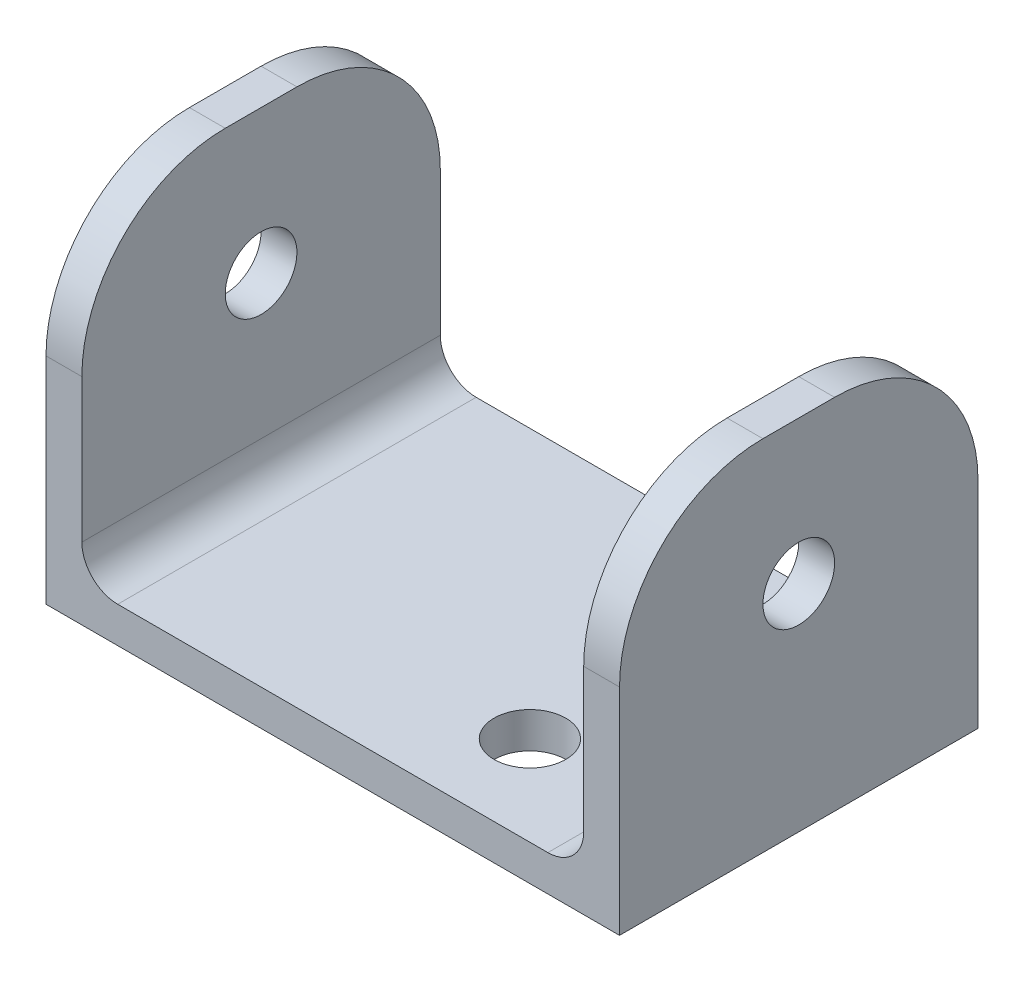
ISO-10303-21;
HEADER;
FILE_DESCRIPTION(('STEP AP214'),'2;1');
FILE_NAME('part.step','',(''),(''),'','','');
FILE_SCHEMA(('AUTOMOTIVE_DESIGN { 1 0 10303 214 1 1 1 1 }'));
ENDSEC;
DATA;
#1=APPLICATION_CONTEXT('core data for automotive mechanical design processes');
#2=APPLICATION_PROTOCOL_DEFINITION('international standard','automotive_design',2000,#1);
#3=PRODUCT_CONTEXT('',#1,'mechanical');
#4=PRODUCT('Part','Part','',(#3));
#5=PRODUCT_RELATED_PRODUCT_CATEGORY('part','',(#4));
#6=PRODUCT_DEFINITION_FORMATION('','',#4);
#7=PRODUCT_DEFINITION_CONTEXT('part definition',#1,'design');
#8=PRODUCT_DEFINITION('design','',#6,#7);
#9=PRODUCT_DEFINITION_SHAPE('','',#8);
#10=(LENGTH_UNIT() NAMED_UNIT(*) SI_UNIT(.MILLI.,.METRE.));
#11=(NAMED_UNIT(*) PLANE_ANGLE_UNIT() SI_UNIT($,.RADIAN.));
#12=(NAMED_UNIT(*) SI_UNIT($,.STERADIAN.) SOLID_ANGLE_UNIT());
#13=UNCERTAINTY_MEASURE_WITH_UNIT(LENGTH_MEASURE(1.E-05),#10,'distance_accuracy_value','');
#14=(GEOMETRIC_REPRESENTATION_CONTEXT(3) GLOBAL_UNCERTAINTY_ASSIGNED_CONTEXT((#13)) GLOBAL_UNIT_ASSIGNED_CONTEXT((#10,
#11,#12)) REPRESENTATION_CONTEXT('',''));
#15=CARTESIAN_POINT('',(0.,0.,0.));
#16=DIRECTION('',(0.,0.,1.));
#17=DIRECTION('',(1.,0.,0.));
#18=AXIS2_PLACEMENT_3D('',#15,#16,#17);
#19=CARTESIAN_POINT('',(-25.4,15.875,-15.875));
#20=DIRECTION('',(0.,-1.,0.));
#21=DIRECTION('',(0.,0.,1.));
#22=AXIS2_PLACEMENT_3D('',#19,#20,#21);
#23=PLANE('',#22);
#24=DIRECTION('',(0.,0.,1.));
#25=VECTOR('',#24,1.);
#26=CARTESIAN_POINT('',(-25.4,15.875,-15.875));
#27=LINE('',#26,#25);
#28=CARTESIAN_POINT('',(-25.4,15.875,-3.175));
#29=VERTEX_POINT('',#28);
#30=CARTESIAN_POINT('',(-25.4,15.875,3.175));
#31=VERTEX_POINT('',#30);
#32=EDGE_CURVE('E157',#29,#31,#27,.T.);
#33=ORIENTED_EDGE('',*,*,#32,.T.);
#34=DIRECTION('',(-1.,0.,0.));
#35=VECTOR('',#34,1.);
#36=CARTESIAN_POINT('',(-25.4,15.875,3.175));
#37=LINE('',#36,#35);
#38=CARTESIAN_POINT('',(-22.225,15.875,3.175));
#39=VERTEX_POINT('',#38);
#40=EDGE_CURVE('E214',#39,#31,#37,.T.);
#41=ORIENTED_EDGE('',*,*,#40,.F.);
#42=DIRECTION('',(0.,0.,-1.));
#43=VECTOR('',#42,1.);
#44=CARTESIAN_POINT('',(-22.225,15.875,15.875));
#45=LINE('',#44,#43);
#46=CARTESIAN_POINT('',(-22.225,15.875,-3.175));
#47=VERTEX_POINT('',#46);
#48=EDGE_CURVE('E171',#39,#47,#45,.T.);
#49=ORIENTED_EDGE('',*,*,#48,.T.);
#50=DIRECTION('',(-1.,0.,0.));
#51=VECTOR('',#50,1.);
#52=CARTESIAN_POINT('',(-22.225,15.875,-3.175));
#53=LINE('',#52,#51);
#54=EDGE_CURVE('E217',#29,#47,#53,.F.);
#55=ORIENTED_EDGE('',*,*,#54,.F.);
#56=EDGE_LOOP('',(#33,#41,#49,#55));
#57=FACE_BOUND('',#56,.T.);
#58=ADVANCED_FACE('F34',(#57),#23,.F.);
#59=CARTESIAN_POINT('',(25.4,15.875,-15.875));
#60=DIRECTION('',(-1.,0.,0.));
#61=DIRECTION('',(0.,0.,-1.));
#62=AXIS2_PLACEMENT_3D('',#59,#60,#61);
#63=PLANE('',#62);
#64=CARTESIAN_POINT('',(25.4,3.17500000000001,0.));
#65=DIRECTION('',(-1.,0.,0.));
#66=DIRECTION('',(0.,1.,0.));
#67=AXIS2_PLACEMENT_3D('',#64,#65,#66);
#68=CIRCLE('',#67,3.175);
#69=CARTESIAN_POINT('',(25.4,6.35000000000001,0.));
#70=VERTEX_POINT('',#69);
#71=EDGE_CURVE('E296',#70,#70,#68,.T.);
#72=ORIENTED_EDGE('',*,*,#71,.T.);
#73=EDGE_LOOP('',(#72));
#74=FACE_BOUND('',#73,.T.);
#75=DIRECTION('',(0.,1.,0.));
#76=VECTOR('',#75,1.);
#77=CARTESIAN_POINT('',(25.4,15.875,15.875));
#78=LINE('',#77,#76);
#79=CARTESIAN_POINT('',(25.4,-15.875,15.875));
#80=VERTEX_POINT('',#79);
#81=CARTESIAN_POINT('',(25.4,3.175,15.875));
#82=VERTEX_POINT('',#81);
#83=EDGE_CURVE('E167',#80,#82,#78,.T.);
#84=ORIENTED_EDGE('',*,*,#83,.F.);
#85=DIRECTION('',(0.,0.,1.));
#86=VECTOR('',#85,1.);
#87=CARTESIAN_POINT('',(25.4,-15.875,-15.875));
#88=LINE('',#87,#86);
#89=CARTESIAN_POINT('',(25.4,-15.875,-15.875));
#90=VERTEX_POINT('',#89);
#91=EDGE_CURVE('E148',#90,#80,#88,.T.);
#92=ORIENTED_EDGE('',*,*,#91,.F.);
#93=DIRECTION('',(0.,1.,0.));
#94=VECTOR('',#93,1.);
#95=CARTESIAN_POINT('',(25.4,15.875,-15.875));
#96=LINE('',#95,#94);
#97=CARTESIAN_POINT('',(25.4,3.175,-15.875));
#98=VERTEX_POINT('',#97);
#99=EDGE_CURVE('E144',#90,#98,#96,.T.);
#100=ORIENTED_EDGE('',*,*,#99,.T.);
#101=CARTESIAN_POINT('',(25.4,3.175,-3.175));
#102=DIRECTION('',(1.,0.,0.));
#103=DIRECTION('',(0.,0.,-1.));
#104=AXIS2_PLACEMENT_3D('',#101,#102,#103);
#105=CIRCLE('',#104,12.7);
#106=CARTESIAN_POINT('',(25.4,15.875,-3.175));
#107=VERTEX_POINT('',#106);
#108=EDGE_CURVE('E42',#107,#98,#105,.F.);
#109=ORIENTED_EDGE('',*,*,#108,.F.);
#110=DIRECTION('',(0.,0.,1.));
#111=VECTOR('',#110,1.);
#112=CARTESIAN_POINT('',(25.4,15.875,-15.875));
#113=LINE('',#112,#111);
#114=CARTESIAN_POINT('',(25.4,15.875,3.175));
#115=VERTEX_POINT('',#114);
#116=EDGE_CURVE('E177',#107,#115,#113,.T.);
#117=ORIENTED_EDGE('',*,*,#116,.T.);
#118=CARTESIAN_POINT('',(25.4,3.175,3.175));
#119=DIRECTION('',(1.,0.,0.));
#120=DIRECTION('',(0.,0.,-1.));
#121=AXIS2_PLACEMENT_3D('',#118,#119,#120);
#122=CIRCLE('',#121,12.7);
#123=EDGE_CURVE('E11',#82,#115,#122,.F.);
#124=ORIENTED_EDGE('',*,*,#123,.F.);
#125=EDGE_LOOP('',(#84,#92,#100,#109,#117,#124));
#126=FACE_BOUND('',#125,.T.);
#127=ADVANCED_FACE('F238',(#74,#126),#63,.F.);
#128=ORIENTED_EDGE('',*,*,#116,.F.);
#129=DIRECTION('',(-1.,0.,0.));
#130=VECTOR('',#129,1.);
#131=CARTESIAN_POINT('',(25.4,15.875,-3.175));
#132=LINE('',#131,#130);
#133=CARTESIAN_POINT('',(22.225,15.875,-3.175));
#134=VERTEX_POINT('',#133);
#135=EDGE_CURVE('E56',#134,#107,#132,.F.);
#136=ORIENTED_EDGE('',*,*,#135,.F.);
#137=DIRECTION('',(0.,0.,-1.));
#138=VECTOR('',#137,1.);
#139=CARTESIAN_POINT('',(22.225,15.875,15.875));
#140=LINE('',#139,#138);
#141=CARTESIAN_POINT('',(22.225,15.875,3.175));
#142=VERTEX_POINT('',#141);
#143=EDGE_CURVE('E275',#142,#134,#140,.T.);
#144=ORIENTED_EDGE('',*,*,#143,.F.);
#145=DIRECTION('',(-1.,0.,0.));
#146=VECTOR('',#145,1.);
#147=CARTESIAN_POINT('',(-25.4,15.875,3.175));
#148=LINE('',#147,#146);
#149=EDGE_CURVE('E49',#115,#142,#148,.T.);
#150=ORIENTED_EDGE('',*,*,#149,.F.);
#151=EDGE_LOOP('',(#128,#136,#144,#150));
#152=FACE_BOUND('',#151,.T.);
#153=ADVANCED_FACE('F306',(#152),#23,.F.);
#154=CARTESIAN_POINT('',(-25.4,15.875,-15.875));
#155=DIRECTION('',(1.,0.,0.));
#156=DIRECTION('',(0.,0.,1.));
#157=AXIS2_PLACEMENT_3D('',#154,#155,#156);
#158=PLANE('',#157);
#159=CARTESIAN_POINT('',(-25.4,3.175,0.));
#160=DIRECTION('',(-1.,0.,0.));
#161=DIRECTION('',(0.,1.,0.));
#162=AXIS2_PLACEMENT_3D('',#159,#160,#161);
#163=CIRCLE('',#162,3.175);
#164=CARTESIAN_POINT('',(-25.4,6.35,0.));
#165=VERTEX_POINT('',#164);
#166=EDGE_CURVE('E205',#165,#165,#163,.T.);
#167=ORIENTED_EDGE('',*,*,#166,.F.);
#168=EDGE_LOOP('',(#167));
#169=FACE_BOUND('',#168,.T.);
#170=DIRECTION('',(0.,-1.,0.));
#171=VECTOR('',#170,1.);
#172=CARTESIAN_POINT('',(-25.4,15.875,-15.875));
#173=LINE('',#172,#171);
#174=CARTESIAN_POINT('',(-25.4,3.175,-15.875));
#175=VERTEX_POINT('',#174);
#176=CARTESIAN_POINT('',(-25.4,-15.875,-15.875));
#177=VERTEX_POINT('',#176);
#178=EDGE_CURVE('E142',#175,#177,#173,.T.);
#179=ORIENTED_EDGE('',*,*,#178,.T.);
#180=DIRECTION('',(0.,0.,1.));
#181=VECTOR('',#180,1.);
#182=CARTESIAN_POINT('',(-25.4,-15.875,-15.875));
#183=LINE('',#182,#181);
#184=CARTESIAN_POINT('',(-25.4,-15.875,15.875));
#185=VERTEX_POINT('',#184);
#186=EDGE_CURVE('E151',#177,#185,#183,.T.);
#187=ORIENTED_EDGE('',*,*,#186,.T.);
#188=DIRECTION('',(0.,-1.,0.));
#189=VECTOR('',#188,1.);
#190=CARTESIAN_POINT('',(-25.4,15.875,15.875));
#191=LINE('',#190,#189);
#192=CARTESIAN_POINT('',(-25.4,3.175,15.875));
#193=VERTEX_POINT('',#192);
#194=EDGE_CURVE('E170',#193,#185,#191,.T.);
#195=ORIENTED_EDGE('',*,*,#194,.F.);
#196=CARTESIAN_POINT('',(-25.4,3.175,3.175));
#197=DIRECTION('',(-1.,0.,0.));
#198=DIRECTION('',(0.,0.,1.));
#199=AXIS2_PLACEMENT_3D('',#196,#197,#198);
#200=CIRCLE('',#199,12.7);
#201=EDGE_CURVE('E210',#31,#193,#200,.F.);
#202=ORIENTED_EDGE('',*,*,#201,.F.);
#203=ORIENTED_EDGE('',*,*,#32,.F.);
#204=CARTESIAN_POINT('',(-25.4,3.175,-3.175));
#205=DIRECTION('',(-1.,0.,0.));
#206=DIRECTION('',(0.,0.,1.));
#207=AXIS2_PLACEMENT_3D('',#204,#205,#206);
#208=CIRCLE('',#207,12.7);
#209=EDGE_CURVE('E162',#175,#29,#208,.F.);
#210=ORIENTED_EDGE('',*,*,#209,.F.);
#211=EDGE_LOOP('',(#179,#187,#195,#202,#203,#210));
#212=FACE_BOUND('',#211,.T.);
#213=ADVANCED_FACE('F160',(#169,#212),#158,.F.);
#214=CARTESIAN_POINT('',(-25.4,-15.875,-15.875));
#215=DIRECTION('',(0.,1.,0.));
#216=DIRECTION('',(0.,0.,-1.));
#217=AXIS2_PLACEMENT_3D('',#214,#215,#216);
#218=PLANE('',#217);
#219=CARTESIAN_POINT('',(9.52500000000001,-15.875,-7.9375));
#220=DIRECTION('',(0.,-1.,0.));
#221=DIRECTION('',(0.,0.,-1.));
#222=AXIS2_PLACEMENT_3D('',#219,#220,#221);
#223=CIRCLE('',#222,3.175);
#224=CARTESIAN_POINT('',(9.52500000000001,-15.875,-11.1125));
#225=VERTEX_POINT('',#224);
#226=EDGE_CURVE('E287',#225,#225,#223,.T.);
#227=ORIENTED_EDGE('',*,*,#226,.F.);
#228=EDGE_LOOP('',(#227));
#229=FACE_BOUND('',#228,.T.);
#230=CARTESIAN_POINT('',(9.52500000000001,-15.875,7.9375));
#231=DIRECTION('',(0.,-1.,0.));
#232=DIRECTION('',(0.,0.,-1.));
#233=AXIS2_PLACEMENT_3D('',#230,#231,#232);
#234=CIRCLE('',#233,3.175);
#235=CARTESIAN_POINT('',(9.52500000000001,-15.875,4.7625));
#236=VERTEX_POINT('',#235);
#237=EDGE_CURVE('E261',#236,#236,#234,.T.);
#238=ORIENTED_EDGE('',*,*,#237,.F.);
#239=EDGE_LOOP('',(#238));
#240=FACE_BOUND('',#239,.T.);
#241=DIRECTION('',(1.,0.,0.));
#242=VECTOR('',#241,1.);
#243=CARTESIAN_POINT('',(-25.4,-15.875,15.875));
#244=LINE('',#243,#242);
#245=EDGE_CURVE('E153',#185,#80,#244,.T.);
#246=ORIENTED_EDGE('',*,*,#245,.F.);
#247=ORIENTED_EDGE('',*,*,#186,.F.);
#248=DIRECTION('',(1.,0.,0.));
#249=VECTOR('',#248,1.);
#250=CARTESIAN_POINT('',(-25.4,-15.875,-15.875));
#251=LINE('',#250,#249);
#252=EDGE_CURVE('E136',#177,#90,#251,.T.);
#253=ORIENTED_EDGE('',*,*,#252,.T.);
#254=ORIENTED_EDGE('',*,*,#91,.T.);
#255=EDGE_LOOP('',(#246,#247,#253,#254));
#256=FACE_BOUND('',#255,.T.);
#257=ADVANCED_FACE('F152',(#229,#240,#256),#218,.F.);
#258=CARTESIAN_POINT('',(25.4,-15.875,-15.875));
#259=DIRECTION('',(0.,0.,-1.));
#260=DIRECTION('',(1.,0.,0.));
#261=AXIS2_PLACEMENT_3D('',#258,#259,#260);
#262=PLANE('',#261);
#263=DIRECTION('',(0.,-1.,0.));
#264=VECTOR('',#263,1.);
#265=CARTESIAN_POINT('',(-22.225,15.875,-15.875));
#266=LINE('',#265,#264);
#267=CARTESIAN_POINT('',(-22.225,3.17500000000001,-15.875));
#268=VERTEX_POINT('',#267);
#269=CARTESIAN_POINT('',(-22.225,-9.52499999999999,-15.875));
#270=VERTEX_POINT('',#269);
#271=EDGE_CURVE('E256',#268,#270,#266,.T.);
#272=ORIENTED_EDGE('',*,*,#271,.T.);
#273=CARTESIAN_POINT('',(-19.05,-9.525,-15.875));
#274=DIRECTION('',(0.,0.,1.));
#275=DIRECTION('',(1.,0.,0.));
#276=AXIS2_PLACEMENT_3D('',#273,#274,#275);
#277=CIRCLE('',#276,3.175);
#278=CARTESIAN_POINT('',(-19.05,-12.7,-15.875));
#279=VERTEX_POINT('',#278);
#280=EDGE_CURVE('E188',#279,#270,#277,.F.);
#281=ORIENTED_EDGE('',*,*,#280,.F.);
#282=DIRECTION('',(1.,0.,0.));
#283=VECTOR('',#282,1.);
#284=CARTESIAN_POINT('',(-22.225,-12.7,-15.875));
#285=LINE('',#284,#283);
#286=CARTESIAN_POINT('',(19.05,-12.7,-15.875));
#287=VERTEX_POINT('',#286);
#288=EDGE_CURVE('E260',#279,#287,#285,.T.);
#289=ORIENTED_EDGE('',*,*,#288,.T.);
#290=CARTESIAN_POINT('',(19.05,-9.525,-15.875));
#291=DIRECTION('',(0.,0.,1.));
#292=DIRECTION('',(1.,0.,0.));
#293=AXIS2_PLACEMENT_3D('',#290,#291,#292);
#294=CIRCLE('',#293,3.175);
#295=CARTESIAN_POINT('',(22.225,-9.52499999999999,-15.875));
#296=VERTEX_POINT('',#295);
#297=EDGE_CURVE('E194',#296,#287,#294,.F.);
#298=ORIENTED_EDGE('',*,*,#297,.F.);
#299=DIRECTION('',(0.,1.,0.));
#300=VECTOR('',#299,1.);
#301=CARTESIAN_POINT('',(22.225,15.875,-15.875));
#302=LINE('',#301,#300);
#303=CARTESIAN_POINT('',(22.225,3.17500000000001,-15.875));
#304=VERTEX_POINT('',#303);
#305=EDGE_CURVE('E264',#296,#304,#302,.T.);
#306=ORIENTED_EDGE('',*,*,#305,.T.);
#307=DIRECTION('',(-1.,0.,0.));
#308=VECTOR('',#307,1.);
#309=CARTESIAN_POINT('',(22.225,3.175,-15.875));
#310=LINE('',#309,#308);
#311=EDGE_CURVE('E200',#98,#304,#310,.T.);
#312=ORIENTED_EDGE('',*,*,#311,.F.);
#313=ORIENTED_EDGE('',*,*,#99,.F.);
#314=ORIENTED_EDGE('',*,*,#252,.F.);
#315=ORIENTED_EDGE('',*,*,#178,.F.);
#316=DIRECTION('',(-1.,0.,0.));
#317=VECTOR('',#316,1.);
#318=CARTESIAN_POINT('',(-25.4,3.175,-15.875));
#319=LINE('',#318,#317);
#320=EDGE_CURVE('E208',#268,#175,#319,.T.);
#321=ORIENTED_EDGE('',*,*,#320,.F.);
#322=EDGE_LOOP('',(#272,#281,#289,#298,#306,#312,#313,#314,#315,#321));
#323=FACE_BOUND('',#322,.T.);
#324=ADVANCED_FACE('F139',(#323),#262,.T.);
#325=CARTESIAN_POINT('',(25.4,-15.875,15.875));
#326=DIRECTION('',(0.,0.,-1.));
#327=DIRECTION('',(1.,0.,0.));
#328=AXIS2_PLACEMENT_3D('',#325,#326,#327);
#329=PLANE('',#328);
#330=ORIENTED_EDGE('',*,*,#194,.T.);
#331=ORIENTED_EDGE('',*,*,#245,.T.);
#332=ORIENTED_EDGE('',*,*,#83,.T.);
#333=DIRECTION('',(-1.,0.,0.));
#334=VECTOR('',#333,1.);
#335=CARTESIAN_POINT('',(25.4,3.175,15.875));
#336=LINE('',#335,#334);
#337=CARTESIAN_POINT('',(22.225,3.17500000000001,15.875));
#338=VERTEX_POINT('',#337);
#339=EDGE_CURVE('E224',#338,#82,#336,.F.);
#340=ORIENTED_EDGE('',*,*,#339,.F.);
#341=DIRECTION('',(0.,1.,0.));
#342=VECTOR('',#341,1.);
#343=CARTESIAN_POINT('',(22.225,15.875,15.875));
#344=LINE('',#343,#342);
#345=CARTESIAN_POINT('',(22.225,-9.52499999999999,15.875));
#346=VERTEX_POINT('',#345);
#347=EDGE_CURVE('E270',#346,#338,#344,.T.);
#348=ORIENTED_EDGE('',*,*,#347,.F.);
#349=CARTESIAN_POINT('',(19.05,-9.525,15.875));
#350=DIRECTION('',(0.,0.,1.));
#351=DIRECTION('',(1.,0.,0.));
#352=AXIS2_PLACEMENT_3D('',#349,#350,#351);
#353=CIRCLE('',#352,3.175);
#354=CARTESIAN_POINT('',(19.05,-12.7,15.875));
#355=VERTEX_POINT('',#354);
#356=EDGE_CURVE('E197',#355,#346,#353,.T.);
#357=ORIENTED_EDGE('',*,*,#356,.F.);
#358=DIRECTION('',(1.,0.,0.));
#359=VECTOR('',#358,1.);
#360=CARTESIAN_POINT('',(-22.225,-12.7,15.875));
#361=LINE('',#360,#359);
#362=CARTESIAN_POINT('',(-19.05,-12.7,15.875));
#363=VERTEX_POINT('',#362);
#364=EDGE_CURVE('E279',#363,#355,#361,.T.);
#365=ORIENTED_EDGE('',*,*,#364,.F.);
#366=CARTESIAN_POINT('',(-19.05,-9.525,15.875));
#367=DIRECTION('',(0.,0.,1.));
#368=DIRECTION('',(1.,0.,0.));
#369=AXIS2_PLACEMENT_3D('',#366,#367,#368);
#370=CIRCLE('',#369,3.175);
#371=CARTESIAN_POINT('',(-22.225,-9.52499999999999,15.875));
#372=VERTEX_POINT('',#371);
#373=EDGE_CURVE('E191',#372,#363,#370,.T.);
#374=ORIENTED_EDGE('',*,*,#373,.F.);
#375=DIRECTION('',(0.,-1.,0.));
#376=VECTOR('',#375,1.);
#377=CARTESIAN_POINT('',(-22.225,15.875,15.875));
#378=LINE('',#377,#376);
#379=CARTESIAN_POINT('',(-22.225,3.17500000000001,15.875));
#380=VERTEX_POINT('',#379);
#381=EDGE_CURVE('E274',#380,#372,#378,.T.);
#382=ORIENTED_EDGE('',*,*,#381,.F.);
#383=DIRECTION('',(-1.,0.,0.));
#384=VECTOR('',#383,1.);
#385=CARTESIAN_POINT('',(25.4,3.175,15.875));
#386=LINE('',#385,#384);
#387=EDGE_CURVE('E226',#193,#380,#386,.F.);
#388=ORIENTED_EDGE('',*,*,#387,.F.);
#389=EDGE_LOOP('',(#330,#331,#332,#340,#348,#357,#365,#374,#382,#388));
#390=FACE_BOUND('',#389,.T.);
#391=ADVANCED_FACE('F242',(#390),#329,.F.);
#392=CARTESIAN_POINT('',(-22.225,15.875,15.875));
#393=DIRECTION('',(-1.,0.,0.));
#394=DIRECTION('',(0.,0.,-1.));
#395=AXIS2_PLACEMENT_3D('',#392,#393,#394);
#396=PLANE('',#395);
#397=CARTESIAN_POINT('',(-22.225,3.175,0.));
#398=DIRECTION('',(1.,0.,0.));
#399=DIRECTION('',(0.,0.,-1.));
#400=AXIS2_PLACEMENT_3D('',#397,#398,#399);
#401=CIRCLE('',#400,3.175);
#402=CARTESIAN_POINT('',(-22.225,6.35,0.));
#403=VERTEX_POINT('',#402);
#404=EDGE_CURVE('E204',#403,#403,#401,.T.);
#405=ORIENTED_EDGE('',*,*,#404,.F.);
#406=EDGE_LOOP('',(#405));
#407=FACE_BOUND('',#406,.T.);
#408=ORIENTED_EDGE('',*,*,#48,.F.);
#409=CARTESIAN_POINT('',(-22.225,3.175,3.175));
#410=DIRECTION('',(1.,0.,0.));
#411=DIRECTION('',(0.,0.,-1.));
#412=AXIS2_PLACEMENT_3D('',#409,#410,#411);
#413=CIRCLE('',#412,12.7);
#414=EDGE_CURVE('E220',#380,#39,#413,.F.);
#415=ORIENTED_EDGE('',*,*,#414,.F.);
#416=ORIENTED_EDGE('',*,*,#381,.T.);
#417=DIRECTION('',(0.,0.,-1.));
#418=VECTOR('',#417,1.);
#419=CARTESIAN_POINT('',(-22.225,-9.525,15.875));
#420=LINE('',#419,#418);
#421=EDGE_CURVE('E184',#270,#372,#420,.F.);
#422=ORIENTED_EDGE('',*,*,#421,.F.);
#423=ORIENTED_EDGE('',*,*,#271,.F.);
#424=CARTESIAN_POINT('',(-22.225,3.175,-3.175));
#425=DIRECTION('',(1.,0.,0.));
#426=DIRECTION('',(0.,0.,-1.));
#427=AXIS2_PLACEMENT_3D('',#424,#425,#426);
#428=CIRCLE('',#427,12.7);
#429=EDGE_CURVE('E222',#47,#268,#428,.F.);
#430=ORIENTED_EDGE('',*,*,#429,.F.);
#431=EDGE_LOOP('',(#408,#415,#416,#422,#423,#430));
#432=FACE_BOUND('',#431,.T.);
#433=ADVANCED_FACE('F258',(#407,#432),#396,.F.);
#434=CARTESIAN_POINT('',(22.225,15.875,15.875));
#435=DIRECTION('',(1.,0.,0.));
#436=DIRECTION('',(0.,0.,1.));
#437=AXIS2_PLACEMENT_3D('',#434,#435,#436);
#438=PLANE('',#437);
#439=CARTESIAN_POINT('',(22.225,3.17500000000001,0.));
#440=DIRECTION('',(-1.,0.,0.));
#441=DIRECTION('',(0.,0.,1.));
#442=AXIS2_PLACEMENT_3D('',#439,#440,#441);
#443=CIRCLE('',#442,3.175);
#444=CARTESIAN_POINT('',(22.225,6.35,0.));
#445=VERTEX_POINT('',#444);
#446=EDGE_CURVE('E201',#445,#445,#443,.T.);
#447=ORIENTED_EDGE('',*,*,#446,.F.);
#448=EDGE_LOOP('',(#447));
#449=FACE_BOUND('',#448,.T.);
#450=ORIENTED_EDGE('',*,*,#143,.T.);
#451=CARTESIAN_POINT('',(22.225,3.175,-3.175));
#452=DIRECTION('',(-1.,0.,0.));
#453=DIRECTION('',(0.,0.,1.));
#454=AXIS2_PLACEMENT_3D('',#451,#452,#453);
#455=CIRCLE('',#454,12.7);
#456=EDGE_CURVE('E231',#304,#134,#455,.F.);
#457=ORIENTED_EDGE('',*,*,#456,.F.);
#458=ORIENTED_EDGE('',*,*,#305,.F.);
#459=DIRECTION('',(0.,0.,-1.));
#460=VECTOR('',#459,1.);
#461=CARTESIAN_POINT('',(22.225,-9.525,-15.875));
#462=LINE('',#461,#460);
#463=EDGE_CURVE('E186',#346,#296,#462,.T.);
#464=ORIENTED_EDGE('',*,*,#463,.F.);
#465=ORIENTED_EDGE('',*,*,#347,.T.);
#466=CARTESIAN_POINT('',(22.225,3.175,3.175));
#467=DIRECTION('',(-1.,0.,0.));
#468=DIRECTION('',(0.,0.,1.));
#469=AXIS2_PLACEMENT_3D('',#466,#467,#468);
#470=CIRCLE('',#469,12.7);
#471=EDGE_CURVE('E233',#142,#338,#470,.F.);
#472=ORIENTED_EDGE('',*,*,#471,.F.);
#473=EDGE_LOOP('',(#450,#457,#458,#464,#465,#472));
#474=FACE_BOUND('',#473,.T.);
#475=ADVANCED_FACE('F341',(#449,#474),#438,.F.);
#476=CARTESIAN_POINT('',(-22.225,-12.7,15.875));
#477=DIRECTION('',(0.,-1.,0.));
#478=DIRECTION('',(0.,0.,1.));
#479=AXIS2_PLACEMENT_3D('',#476,#477,#478);
#480=PLANE('',#479);
#481=CARTESIAN_POINT('',(9.52500000000001,-12.7,-7.9375));
#482=DIRECTION('',(0.,-1.,0.));
#483=DIRECTION('',(0.,0.,-1.));
#484=AXIS2_PLACEMENT_3D('',#481,#482,#483);
#485=CIRCLE('',#484,3.175);
#486=CARTESIAN_POINT('',(9.52500000000001,-12.7,-11.1125));
#487=VERTEX_POINT('',#486);
#488=EDGE_CURVE('E289',#487,#487,#485,.T.);
#489=ORIENTED_EDGE('',*,*,#488,.T.);
#490=EDGE_LOOP('',(#489));
#491=FACE_BOUND('',#490,.T.);
#492=CARTESIAN_POINT('',(9.52500000000001,-12.7,7.9375));
#493=DIRECTION('',(0.,-1.,0.));
#494=DIRECTION('',(0.,0.,-1.));
#495=AXIS2_PLACEMENT_3D('',#492,#493,#494);
#496=CIRCLE('',#495,3.175);
#497=CARTESIAN_POINT('',(9.52500000000001,-12.7,4.7625));
#498=VERTEX_POINT('',#497);
#499=EDGE_CURVE('E267',#498,#498,#496,.T.);
#500=ORIENTED_EDGE('',*,*,#499,.T.);
#501=EDGE_LOOP('',(#500));
#502=FACE_BOUND('',#501,.T.);
#503=ORIENTED_EDGE('',*,*,#364,.T.);
#504=DIRECTION('',(0.,0.,-1.));
#505=VECTOR('',#504,1.);
#506=CARTESIAN_POINT('',(19.05,-12.7,15.875));
#507=LINE('',#506,#505);
#508=EDGE_CURVE('E180',#287,#355,#507,.F.);
#509=ORIENTED_EDGE('',*,*,#508,.F.);
#510=ORIENTED_EDGE('',*,*,#288,.F.);
#511=DIRECTION('',(0.,0.,-1.));
#512=VECTOR('',#511,1.);
#513=CARTESIAN_POINT('',(-19.05,-12.7,-15.875));
#514=LINE('',#513,#512);
#515=EDGE_CURVE('E182',#363,#279,#514,.T.);
#516=ORIENTED_EDGE('',*,*,#515,.F.);
#517=EDGE_LOOP('',(#503,#509,#510,#516));
#518=FACE_BOUND('',#517,.T.);
#519=ADVANCED_FACE('F343',(#491,#502,#518),#480,.F.);
#520=CARTESIAN_POINT('',(9.52500000000001,-15.875,7.9375));
#521=DIRECTION('',(0.,1.,0.));
#522=DIRECTION('',(0.,0.,-1.));
#523=AXIS2_PLACEMENT_3D('',#520,#521,#522);
#524=CYLINDRICAL_SURFACE('',#523,3.175);
#525=ORIENTED_EDGE('',*,*,#237,.T.);
#526=EDGE_LOOP('',(#525));
#527=FACE_BOUND('',#526,.T.);
#528=ORIENTED_EDGE('',*,*,#499,.F.);
#529=EDGE_LOOP('',(#528));
#530=FACE_BOUND('',#529,.T.);
#531=ADVANCED_FACE('F350',(#527,#530),#524,.F.);
#532=CARTESIAN_POINT('',(9.52500000000001,-15.875,-7.9375));
#533=DIRECTION('',(0.,1.,0.));
#534=DIRECTION('',(0.,0.,-1.));
#535=AXIS2_PLACEMENT_3D('',#532,#533,#534);
#536=CYLINDRICAL_SURFACE('',#535,3.175);
#537=ORIENTED_EDGE('',*,*,#226,.T.);
#538=EDGE_LOOP('',(#537));
#539=FACE_BOUND('',#538,.T.);
#540=ORIENTED_EDGE('',*,*,#488,.F.);
#541=EDGE_LOOP('',(#540));
#542=FACE_BOUND('',#541,.T.);
#543=ADVANCED_FACE('F326',(#539,#542),#536,.F.);
#544=CARTESIAN_POINT('',(-19.05,-9.525,15.875));
#545=DIRECTION('',(0.,0.,1.));
#546=DIRECTION('',(-1.,0.,0.));
#547=AXIS2_PLACEMENT_3D('',#544,#545,#546);
#548=CYLINDRICAL_SURFACE('',#547,3.175);
#549=ORIENTED_EDGE('',*,*,#373,.T.);
#550=ORIENTED_EDGE('',*,*,#515,.T.);
#551=ORIENTED_EDGE('',*,*,#280,.T.);
#552=ORIENTED_EDGE('',*,*,#421,.T.);
#553=EDGE_LOOP('',(#549,#550,#551,#552));
#554=FACE_BOUND('',#553,.T.);
#555=ADVANCED_FACE('F322',(#554),#548,.F.);
#556=CARTESIAN_POINT('',(19.05,-9.525,15.875));
#557=DIRECTION('',(0.,0.,1.));
#558=DIRECTION('',(-1.,0.,0.));
#559=AXIS2_PLACEMENT_3D('',#556,#557,#558);
#560=CYLINDRICAL_SURFACE('',#559,3.175);
#561=ORIENTED_EDGE('',*,*,#356,.T.);
#562=ORIENTED_EDGE('',*,*,#463,.T.);
#563=ORIENTED_EDGE('',*,*,#297,.T.);
#564=ORIENTED_EDGE('',*,*,#508,.T.);
#565=EDGE_LOOP('',(#561,#562,#563,#564));
#566=FACE_BOUND('',#565,.T.);
#567=ADVANCED_FACE('F325',(#566),#560,.F.);
#568=CARTESIAN_POINT('',(-25.4,3.175,0.));
#569=DIRECTION('',(1.,0.,0.));
#570=DIRECTION('',(0.,1.,0.));
#571=AXIS2_PLACEMENT_3D('',#568,#569,#570);
#572=CYLINDRICAL_SURFACE('',#571,3.175);
#573=CARTESIAN_POINT('',(25.4,6.35000000000001,0.));
#574=CARTESIAN_POINT('',(25.3669270833333,6.35000000000001,0.));
#575=CARTESIAN_POINT('',(25.3338541666667,6.35000000000001,0.));
#576=CARTESIAN_POINT('',(25.2677083333333,6.35000000000001,0.));
#577=CARTESIAN_POINT('',(25.2346354166667,6.35000000000001,0.));
#578=CARTESIAN_POINT('',(25.1684895833333,6.35000000000001,0.));
#579=CARTESIAN_POINT('',(25.1354166666667,6.35000000000001,0.));
#580=CARTESIAN_POINT('',(25.0692708333333,6.35000000000001,0.));
#581=CARTESIAN_POINT('',(25.0361979166667,6.35000000000001,0.));
#582=CARTESIAN_POINT('',(24.9700520833333,6.35000000000001,0.));
#583=CARTESIAN_POINT('',(24.9369791666667,6.35000000000001,0.));
#584=CARTESIAN_POINT('',(24.8708333333333,6.35000000000001,0.));
#585=CARTESIAN_POINT('',(24.8377604166667,6.35000000000001,0.));
#586=CARTESIAN_POINT('',(24.7716145833333,6.35000000000001,0.));
#587=CARTESIAN_POINT('',(24.7385416666667,6.35000000000001,0.));
#588=CARTESIAN_POINT('',(24.6723958333333,6.35000000000001,0.));
#589=CARTESIAN_POINT('',(24.6393229166667,6.35000000000001,0.));
#590=CARTESIAN_POINT('',(24.5731770833333,6.35000000000001,0.));
#591=CARTESIAN_POINT('',(24.5401041666667,6.35,0.));
#592=CARTESIAN_POINT('',(24.4739583333333,6.35,0.));
#593=CARTESIAN_POINT('',(24.4408854166667,6.35,0.));
#594=CARTESIAN_POINT('',(24.3747395833333,6.35,0.));
#595=CARTESIAN_POINT('',(24.3416666666667,6.35,0.));
#596=CARTESIAN_POINT('',(24.2755208333333,6.35,0.));
#597=CARTESIAN_POINT('',(24.2424479166667,6.35,0.));
#598=CARTESIAN_POINT('',(24.1763020833333,6.35,0.));
#599=CARTESIAN_POINT('',(24.1432291666667,6.35,0.));
#600=CARTESIAN_POINT('',(24.0770833333333,6.35,0.));
#601=CARTESIAN_POINT('',(24.0440104166667,6.35,0.));
#602=CARTESIAN_POINT('',(23.9778645833333,6.35,0.));
#603=CARTESIAN_POINT('',(23.9447916666667,6.35,0.));
#604=CARTESIAN_POINT('',(23.8786458333333,6.35,0.));
#605=CARTESIAN_POINT('',(23.8455729166667,6.35,0.));
#606=CARTESIAN_POINT('',(23.7794270833333,6.35,0.));
#607=CARTESIAN_POINT('',(23.7463541666667,6.35,0.));
#608=CARTESIAN_POINT('',(23.6802083333333,6.35,0.));
#609=CARTESIAN_POINT('',(23.6471354166667,6.35,0.));
#610=CARTESIAN_POINT('',(23.5809895833333,6.35,0.));
#611=CARTESIAN_POINT('',(23.5479166666667,6.35,0.));
#612=CARTESIAN_POINT('',(23.4817708333333,6.35,0.));
#613=CARTESIAN_POINT('',(23.4486979166667,6.35,0.));
#614=CARTESIAN_POINT('',(23.3825520833333,6.35,0.));
#615=CARTESIAN_POINT('',(23.3494791666667,6.35,0.));
#616=CARTESIAN_POINT('',(23.2833333333333,6.35,0.));
#617=CARTESIAN_POINT('',(23.2502604166667,6.35,0.));
#618=CARTESIAN_POINT('',(23.1841145833333,6.35,0.));
#619=CARTESIAN_POINT('',(23.1510416666667,6.35,0.));
#620=CARTESIAN_POINT('',(23.0848958333333,6.35,0.));
#621=CARTESIAN_POINT('',(23.0518229166667,6.35,0.));
#622=CARTESIAN_POINT('',(22.9856770833333,6.35,0.));
#623=CARTESIAN_POINT('',(22.9526041666667,6.35,0.));
#624=CARTESIAN_POINT('',(22.8864583333333,6.35,0.));
#625=CARTESIAN_POINT('',(22.8533854166667,6.35,0.));
#626=CARTESIAN_POINT('',(22.7872395833333,6.35,0.));
#627=CARTESIAN_POINT('',(22.7541666666667,6.35,0.));
#628=CARTESIAN_POINT('',(22.6880208333333,6.35,0.));
#629=CARTESIAN_POINT('',(22.6549479166667,6.35,0.));
#630=CARTESIAN_POINT('',(22.5888020833333,6.35,0.));
#631=CARTESIAN_POINT('',(22.5557291666667,6.35,0.));
#632=CARTESIAN_POINT('',(22.4895833333333,6.35,0.));
#633=CARTESIAN_POINT('',(22.4565104166667,6.35,0.));
#634=CARTESIAN_POINT('',(22.3903645833333,6.35,0.));
#635=CARTESIAN_POINT('',(22.3572916666667,6.35,0.));
#636=CARTESIAN_POINT('',(22.2911458333333,6.35,0.));
#637=CARTESIAN_POINT('',(22.2580729166667,6.35,0.));
#638=CARTESIAN_POINT('',(22.225,6.35,0.));
#639=B_SPLINE_CURVE_WITH_KNOTS('',3,(#573,#574,#575,#576,#577,#578,#579,#580,#581,#582,#583,
#584,#585,#586,#587,#588,#589,#590,#591,#592,#593,#594,#595,#596,#597,#598,#599,#600,#601,#602,
#603,#604,#605,#606,#607,#608,#609,#610,#611,#612,#613,#614,#615,#616,#617,#618,#619,#620,#621,
#622,#623,#624,#625,#626,#627,#628,#629,#630,#631,#632,#633,#634,#635,#636,#637,#638),
.UNSPECIFIED.,.F.,.F.,(4,2,2,2,2,2,2,2,2,2,2,2,2,2,2,2,2,2,2,2,2,2,2,2,2,2,2,2,2,2,2,2,4),(0.,
0.0992187499999977,0.198437500000002,0.29765625,0.396874999999998,0.496093750000003,0.5953125,
0.694531249999998,0.793749999999996,0.892968750000001,0.992187499999998,1.09140625,1.190625,
1.28984375,1.3890625,1.48828125,1.5875,1.68671875,1.7859375,1.88515625,1.984375,2.08359375,
2.1828125,2.28203125,2.38125,2.48046875,2.5796875,2.67890624999999,2.778125,2.87734375,
2.97656249999999,3.07578125,3.175),.UNSPECIFIED.);
#640=EDGE_CURVE('BSEAM330',#70,#445,#639,.T.);
#641=ORIENTED_EDGE('',*,*,#71,.F.);
#642=ORIENTED_EDGE('',*,*,#446,.T.);
#643=ORIENTED_EDGE('',*,*,#640,.T.);
#644=ORIENTED_EDGE('',*,*,#640,.F.);
#645=EDGE_LOOP('',(#641,#643,#642,#644));
#646=FACE_BOUND('',#645,.T.);
#647=ADVANCED_FACE('F330',(#646),#572,.F.);
#648=CARTESIAN_POINT('',(-25.4,6.35,0.));
#649=CARTESIAN_POINT('',(-25.3669270833333,6.35,0.));
#650=CARTESIAN_POINT('',(-25.3338541666667,6.35,0.));
#651=CARTESIAN_POINT('',(-25.2677083333333,6.35,0.));
#652=CARTESIAN_POINT('',(-25.2346354166667,6.35,0.));
#653=CARTESIAN_POINT('',(-25.1684895833333,6.35,0.));
#654=CARTESIAN_POINT('',(-25.1354166666667,6.35,0.));
#655=CARTESIAN_POINT('',(-25.0692708333333,6.35,0.));
#656=CARTESIAN_POINT('',(-25.0361979166667,6.35,0.));
#657=CARTESIAN_POINT('',(-24.9700520833333,6.35,0.));
#658=CARTESIAN_POINT('',(-24.9369791666667,6.35,0.));
#659=CARTESIAN_POINT('',(-24.8708333333333,6.35,0.));
#660=CARTESIAN_POINT('',(-24.8377604166667,6.35,0.));
#661=CARTESIAN_POINT('',(-24.7716145833333,6.35,0.));
#662=CARTESIAN_POINT('',(-24.7385416666667,6.35,0.));
#663=CARTESIAN_POINT('',(-24.6723958333333,6.35,0.));
#664=CARTESIAN_POINT('',(-24.6393229166667,6.35,0.));
#665=CARTESIAN_POINT('',(-24.5731770833333,6.35,0.));
#666=CARTESIAN_POINT('',(-24.5401041666667,6.35,0.));
#667=CARTESIAN_POINT('',(-24.4739583333333,6.35,0.));
#668=CARTESIAN_POINT('',(-24.4408854166667,6.35,0.));
#669=CARTESIAN_POINT('',(-24.3747395833333,6.35,0.));
#670=CARTESIAN_POINT('',(-24.3416666666667,6.35,0.));
#671=CARTESIAN_POINT('',(-24.2755208333333,6.35,0.));
#672=CARTESIAN_POINT('',(-24.2424479166667,6.35,0.));
#673=CARTESIAN_POINT('',(-24.1763020833333,6.35,0.));
#674=CARTESIAN_POINT('',(-24.1432291666667,6.35,0.));
#675=CARTESIAN_POINT('',(-24.0770833333333,6.35,0.));
#676=CARTESIAN_POINT('',(-24.0440104166667,6.35,0.));
#677=CARTESIAN_POINT('',(-23.9778645833333,6.35,0.));
#678=CARTESIAN_POINT('',(-23.9447916666667,6.35,0.));
#679=CARTESIAN_POINT('',(-23.8786458333333,6.35,0.));
#680=CARTESIAN_POINT('',(-23.8455729166667,6.35,0.));
#681=CARTESIAN_POINT('',(-23.7794270833333,6.35,0.));
#682=CARTESIAN_POINT('',(-23.7463541666667,6.35,0.));
#683=CARTESIAN_POINT('',(-23.6802083333333,6.35,0.));
#684=CARTESIAN_POINT('',(-23.6471354166667,6.35,0.));
#685=CARTESIAN_POINT('',(-23.5809895833333,6.35,0.));
#686=CARTESIAN_POINT('',(-23.5479166666667,6.35,0.));
#687=CARTESIAN_POINT('',(-23.4817708333333,6.35,0.));
#688=CARTESIAN_POINT('',(-23.4486979166667,6.35,0.));
#689=CARTESIAN_POINT('',(-23.3825520833333,6.35,0.));
#690=CARTESIAN_POINT('',(-23.3494791666667,6.35,0.));
#691=CARTESIAN_POINT('',(-23.2833333333333,6.35,0.));
#692=CARTESIAN_POINT('',(-23.2502604166667,6.35,0.));
#693=CARTESIAN_POINT('',(-23.1841145833333,6.35,0.));
#694=CARTESIAN_POINT('',(-23.1510416666667,6.35,0.));
#695=CARTESIAN_POINT('',(-23.0848958333333,6.35,0.));
#696=CARTESIAN_POINT('',(-23.0518229166667,6.35,0.));
#697=CARTESIAN_POINT('',(-22.9856770833333,6.35,0.));
#698=CARTESIAN_POINT('',(-22.9526041666667,6.35,0.));
#699=CARTESIAN_POINT('',(-22.8864583333333,6.35,0.));
#700=CARTESIAN_POINT('',(-22.8533854166667,6.35,0.));
#701=CARTESIAN_POINT('',(-22.7872395833333,6.35,0.));
#702=CARTESIAN_POINT('',(-22.7541666666667,6.35,0.));
#703=CARTESIAN_POINT('',(-22.6880208333333,6.35,0.));
#704=CARTESIAN_POINT('',(-22.6549479166667,6.35,0.));
#705=CARTESIAN_POINT('',(-22.5888020833333,6.35,0.));
#706=CARTESIAN_POINT('',(-22.5557291666667,6.35,0.));
#707=CARTESIAN_POINT('',(-22.4895833333333,6.35,0.));
#708=CARTESIAN_POINT('',(-22.4565104166667,6.35,0.));
#709=CARTESIAN_POINT('',(-22.3903645833333,6.35,0.));
#710=CARTESIAN_POINT('',(-22.3572916666667,6.35,0.));
#711=CARTESIAN_POINT('',(-22.2911458333333,6.35,0.));
#712=CARTESIAN_POINT('',(-22.2580729166667,6.35,0.));
#713=CARTESIAN_POINT('',(-22.225,6.35,0.));
#714=B_SPLINE_CURVE_WITH_KNOTS('',3,(#648,#649,#650,#651,#652,#653,#654,#655,#656,#657,#658,
#659,#660,#661,#662,#663,#664,#665,#666,#667,#668,#669,#670,#671,#672,#673,#674,#675,#676,#677,
#678,#679,#680,#681,#682,#683,#684,#685,#686,#687,#688,#689,#690,#691,#692,#693,#694,#695,#696,
#697,#698,#699,#700,#701,#702,#703,#704,#705,#706,#707,#708,#709,#710,#711,#712,#713),
.UNSPECIFIED.,.F.,.F.,(4,2,2,2,2,2,2,2,2,2,2,2,2,2,2,2,2,2,2,2,2,2,2,2,2,2,2,2,2,2,2,2,4),(0.,
0.0992187500000012,0.198437500000002,0.297656250000004,0.396875000000001,0.496093750000003,
0.595312500000004,0.694531250000005,0.793750000000003,0.892968750000004,0.992187500000005,
1.09140625,1.190625,1.28984375000001,1.38906250000001,1.48828125,1.58750000000001,
1.68671875000001,1.7859375,1.88515625000001,1.98437500000001,2.08359375000001,2.18281250000001,
2.28203125000001,2.38125000000001,2.48046875000001,2.57968750000001,2.67890625000001,
2.77812500000001,2.87734375000001,2.97656250000001,3.07578125000001,3.17500000000001),.UNSPECIFIED.);
#715=EDGE_CURVE('BSEAM302',#165,#403,#714,.T.);
#716=ORIENTED_EDGE('',*,*,#166,.T.);
#717=ORIENTED_EDGE('',*,*,#404,.T.);
#718=ORIENTED_EDGE('',*,*,#715,.T.);
#719=ORIENTED_EDGE('',*,*,#715,.F.);
#720=EDGE_LOOP('',(#716,#718,#717,#719));
#721=FACE_BOUND('',#720,.T.);
#722=ADVANCED_FACE('F302',(#721),#572,.F.);
#723=CARTESIAN_POINT('',(25.4,3.175,-3.175));
#724=DIRECTION('',(1.,0.,0.));
#725=DIRECTION('',(0.,0.,1.));
#726=AXIS2_PLACEMENT_3D('',#723,#724,#725);
#727=CYLINDRICAL_SURFACE('',#726,12.7);
#728=ORIENTED_EDGE('',*,*,#429,.T.);
#729=ORIENTED_EDGE('',*,*,#320,.T.);
#730=ORIENTED_EDGE('',*,*,#209,.T.);
#731=ORIENTED_EDGE('',*,*,#54,.T.);
#732=EDGE_LOOP('',(#728,#729,#730,#731));
#733=FACE_BOUND('',#732,.T.);
#734=ADVANCED_FACE('F253',(#733),#727,.T.);
#735=CARTESIAN_POINT('',(-25.4,3.175,3.175));
#736=DIRECTION('',(-1.,0.,0.));
#737=DIRECTION('',(0.,0.,-1.));
#738=AXIS2_PLACEMENT_3D('',#735,#736,#737);
#739=CYLINDRICAL_SURFACE('',#738,12.7);
#740=ORIENTED_EDGE('',*,*,#414,.T.);
#741=ORIENTED_EDGE('',*,*,#40,.T.);
#742=ORIENTED_EDGE('',*,*,#201,.T.);
#743=ORIENTED_EDGE('',*,*,#387,.T.);
#744=EDGE_LOOP('',(#740,#741,#742,#743));
#745=FACE_BOUND('',#744,.T.);
#746=ADVANCED_FACE('F247',(#745),#739,.T.);
#747=CARTESIAN_POINT('',(-25.4,3.175,3.175));
#748=DIRECTION('',(-1.,0.,0.));
#749=DIRECTION('',(0.,0.,-1.));
#750=AXIS2_PLACEMENT_3D('',#747,#748,#749);
#751=CYLINDRICAL_SURFACE('',#750,12.7);
#752=ORIENTED_EDGE('',*,*,#123,.T.);
#753=ORIENTED_EDGE('',*,*,#149,.T.);
#754=ORIENTED_EDGE('',*,*,#471,.T.);
#755=ORIENTED_EDGE('',*,*,#339,.T.);
#756=EDGE_LOOP('',(#752,#753,#754,#755));
#757=FACE_BOUND('',#756,.T.);
#758=ADVANCED_FACE('F335',(#757),#751,.T.);
#759=CARTESIAN_POINT('',(25.4,3.175,-3.175));
#760=DIRECTION('',(1.,0.,0.));
#761=DIRECTION('',(0.,0.,1.));
#762=AXIS2_PLACEMENT_3D('',#759,#760,#761);
#763=CYLINDRICAL_SURFACE('',#762,12.7);
#764=ORIENTED_EDGE('',*,*,#108,.T.);
#765=ORIENTED_EDGE('',*,*,#311,.T.);
#766=ORIENTED_EDGE('',*,*,#456,.T.);
#767=ORIENTED_EDGE('',*,*,#135,.T.);
#768=EDGE_LOOP('',(#764,#765,#766,#767));
#769=FACE_BOUND('',#768,.T.);
#770=ADVANCED_FACE('F36',(#769),#763,.T.);
#771=CLOSED_SHELL('',(#58,#127,#153,#213,#257,#324,#391,#433,#475,#519,#531,#543,#555,#567,#647,
#722,#734,#746,#758,#770));
#772=MANIFOLD_SOLID_BREP('B2',#771);
#773=ADVANCED_BREP_SHAPE_REPRESENTATION('',(#18,#772),#14);
#774=SHAPE_DEFINITION_REPRESENTATION(#9,#773);
ENDSEC;
END-ISO-10303-21;
